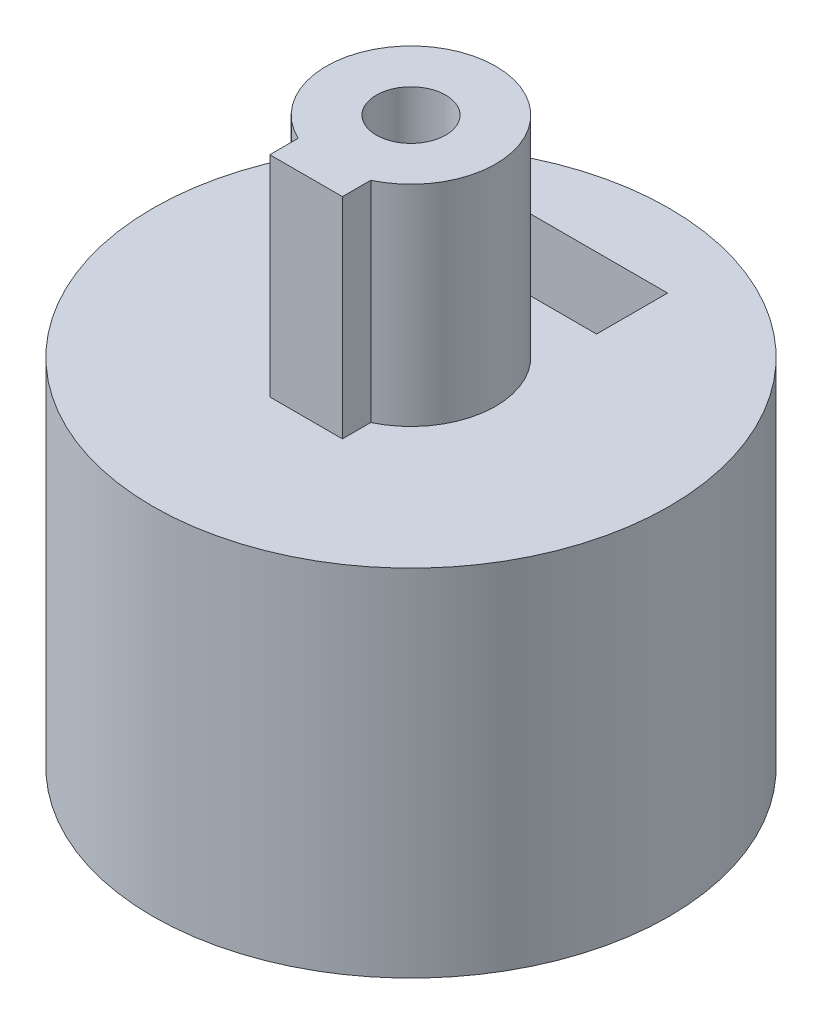
ISO-10303-21;
HEADER;
FILE_DESCRIPTION(('STEP AP214'),'2;1');
FILE_NAME('part.step','',(''),(''),'','','');
FILE_SCHEMA(('AUTOMOTIVE_DESIGN { 1 0 10303 214 1 1 1 1 }'));
ENDSEC;
DATA;
#1=APPLICATION_CONTEXT('core data for automotive mechanical design processes');
#2=APPLICATION_PROTOCOL_DEFINITION('international standard','automotive_design',2000,#1);
#3=PRODUCT_CONTEXT('',#1,'mechanical');
#4=PRODUCT('Part','Part','',(#3));
#5=PRODUCT_RELATED_PRODUCT_CATEGORY('part','',(#4));
#6=PRODUCT_DEFINITION_FORMATION('','',#4);
#7=PRODUCT_DEFINITION_CONTEXT('part definition',#1,'design');
#8=PRODUCT_DEFINITION('design','',#6,#7);
#9=PRODUCT_DEFINITION_SHAPE('','',#8);
#10=(LENGTH_UNIT() NAMED_UNIT(*) SI_UNIT(.MILLI.,.METRE.));
#11=(NAMED_UNIT(*) PLANE_ANGLE_UNIT() SI_UNIT($,.RADIAN.));
#12=(NAMED_UNIT(*) SI_UNIT($,.STERADIAN.) SOLID_ANGLE_UNIT());
#13=UNCERTAINTY_MEASURE_WITH_UNIT(LENGTH_MEASURE(1.E-05),#10,'distance_accuracy_value','');
#14=(GEOMETRIC_REPRESENTATION_CONTEXT(3) GLOBAL_UNCERTAINTY_ASSIGNED_CONTEXT((#13)) GLOBAL_UNIT_ASSIGNED_CONTEXT((#10,
#11,#12)) REPRESENTATION_CONTEXT('',''));
#15=CARTESIAN_POINT('',(0.,0.,0.));
#16=DIRECTION('',(0.,0.,1.));
#17=DIRECTION('',(1.,0.,0.));
#18=AXIS2_PLACEMENT_3D('',#15,#16,#17);
#19=CARTESIAN_POINT('',(0.,7.,-8.));
#20=DIRECTION('',(0.,0.,1.));
#21=DIRECTION('',(1.,0.,0.));
#22=AXIS2_PLACEMENT_3D('',#19,#20,#21);
#23=CYLINDRICAL_SURFACE('',#22,1.075);
#24=CARTESIAN_POINT('',(0.,8.075,-8.));
#25=CARTESIAN_POINT('',(-0.060092794416397,8.0749974716429,-7.99999911181547));
#26=CARTESIAN_POINT('',(-0.120222192972751,8.06994419701879,-7.99931577898279));
#27=CARTESIAN_POINT('',(-0.238805133904426,8.04986697138058,-7.99665557002145));
#28=CARTESIAN_POINT('',(-0.29725690477915,8.03483285792277,-7.99467737549948));
#29=CARTESIAN_POINT('',(-0.410750903373487,7.99524717671987,-7.98965010312977));
#30=CARTESIAN_POINT('',(-0.465795495107335,7.97070229568787,-7.98660177779764));
#31=CARTESIAN_POINT('',(-0.570974704442025,7.91280707597931,-7.97977249916764));
#32=CARTESIAN_POINT('',(-0.621110105394015,7.8794581452991,-7.97599166304299));
#33=CARTESIAN_POINT('',(-0.715374578934897,7.80467629140163,-7.96809215514065));
#34=CARTESIAN_POINT('',(-0.759468116078188,7.7631987590954,-7.96397169531925));
#35=CARTESIAN_POINT('',(-0.840090960456325,7.67343298240961,-7.95587160681168));
#36=CARTESIAN_POINT('',(-0.876619865343444,7.6251443759921,-7.95189198562576));
#37=CARTESIAN_POINT('',(-0.941211112757503,7.52289333607248,-7.9445066814414));
#38=CARTESIAN_POINT('',(-0.96923975909554,7.46890943589338,-7.94110330569616));
#39=CARTESIAN_POINT('',(-1.01581962032494,7.35694724671609,-7.93527976050471));
#40=CARTESIAN_POINT('',(-1.03437124968407,7.29896913252668,-7.9328595480618));
#41=CARTESIAN_POINT('',(-1.06136159068698,7.1810350299197,-7.92929364263999));
#42=CARTESIAN_POINT('',(-1.06986062842502,7.12109308156808,-7.92814034982218));
#43=CARTESIAN_POINT('',(-1.07669127649231,7.00062347246384,-7.92721568300875));
#44=CARTESIAN_POINT('',(-1.07502335732068,6.94009583894456,-7.92744424506463));
#45=CARTESIAN_POINT('',(-1.06161687859971,6.82059545416212,-7.92925050898512));
#46=CARTESIAN_POINT('',(-1.04994502946319,6.76161506442997,-7.93081927358998));
#47=CARTESIAN_POINT('',(-1.01696621809526,6.64645766408446,-7.93511523718938));
#48=CARTESIAN_POINT('',(-0.995659033025943,6.59028071834016,-7.93784246297574));
#49=CARTESIAN_POINT('',(-0.943943504820709,6.48211913483119,-7.94415810307942));
#50=CARTESIAN_POINT('',(-0.91350643259143,6.43014839814982,-7.94774922866829));
#51=CARTESIAN_POINT('',(-0.844415645078879,6.33202690954449,-7.95538599590865));
#52=CARTESIAN_POINT('',(-0.805761495901629,6.28587646515996,-7.95943166155632));
#53=CARTESIAN_POINT('',(-0.72096534034505,6.20031859555403,-7.96756131308648));
#54=CARTESIAN_POINT('',(-0.674765883601231,6.16096809139185,-7.97164534652604));
#55=CARTESIAN_POINT('',(-0.576387641394186,6.09057119789945,-7.97936135707552));
#56=CARTESIAN_POINT('',(-0.524208838232408,6.05952483314996,-7.9829933328473));
#57=CARTESIAN_POINT('',(-0.415307245576307,6.00661645208213,-7.9893987712116));
#58=CARTESIAN_POINT('',(-0.358582559777428,5.98475829259759,-7.99217187315562));
#59=CARTESIAN_POINT('',(-0.242222292292283,5.95089349797181,-7.99654394552587));
#60=CARTESIAN_POINT('',(-0.182586868427062,5.93888632933432,-7.99814297953514));
#61=CARTESIAN_POINT('',(-0.0625898012162963,5.92513880738972,-7.9999784296808));
#62=CARTESIAN_POINT('',(-0.00223728762374069,5.92332009876711,-8.00022524485916));
#63=CARTESIAN_POINT('',(0.117911724838873,5.92979391809772,-7.99935660669511));
#64=CARTESIAN_POINT('',(0.17770823740325,5.93808619634886,-7.9982411869946));
#65=CARTESIAN_POINT('',(0.294814467290954,5.96448148197648,-7.99477986364423));
#66=CARTESIAN_POINT('',(0.352132822198141,5.98254683979153,-7.99243868319097));
#67=CARTESIAN_POINT('',(0.462926687427366,6.02793613444639,-7.98678776857183));
#68=CARTESIAN_POINT('',(0.516402048969415,6.05526042950856,-7.98347799693244));
#69=CARTESIAN_POINT('',(0.618339997276848,6.11857949699144,-7.97623254623426));
#70=CARTESIAN_POINT('',(0.666771056604777,6.15462460803785,-7.9722932801175));
#71=CARTESIAN_POINT('',(0.756924161786225,6.23429130813548,-7.96423996670908));
#72=CARTESIAN_POINT('',(0.798645897904572,6.27791324677686,-7.96012591135936));
#73=CARTESIAN_POINT('',(0.874476563734168,6.37184181892993,-7.95215429437211));
#74=CARTESIAN_POINT('',(0.908533341440052,6.42219073865829,-7.94829860823129));
#75=CARTESIAN_POINT('',(0.967706275855308,6.52794027022739,-7.94131198807677));
#76=CARTESIAN_POINT('',(0.992822634799581,6.58334076776433,-7.93818103766989));
#77=CARTESIAN_POINT('',(1.0333186048018,6.69745709747159,-7.93301147151021));
#78=CARTESIAN_POINT('',(1.04872692328245,6.75616259029887,-7.93096963792837));
#79=CARTESIAN_POINT('',(1.0694615190423,6.87535712142325,-7.92820050841194));
#80=CARTESIAN_POINT('',(1.0747883447589,6.9358460625182,-7.92747314096993));
#81=CARTESIAN_POINT('',(1.07519762316741,7.05637127799591,-7.92741759795498));
#82=CARTESIAN_POINT('',(1.07036202694493,7.11640728526354,-7.92807822936805));
#83=CARTESIAN_POINT('',(1.050758002377,7.23480464678056,-7.93070009140945));
#84=CARTESIAN_POINT('',(1.03598957841016,7.29316600176818,-7.93266132146445));
#85=CARTESIAN_POINT('',(0.996965959588734,7.40654235253583,-7.93765977747413));
#86=CARTESIAN_POINT('',(0.972715350353342,7.46155895101431,-7.94069648325804));
#87=CARTESIAN_POINT('',(0.91542380231593,7.56675546596662,-7.947504501913));
#88=CARTESIAN_POINT('',(0.882382686123591,7.61693528480755,-7.95127582960813));
#89=CARTESIAN_POINT('',(0.808146125167278,7.71145191495493,-7.95916452760708));
#90=CARTESIAN_POINT('',(0.766889712712126,7.7557406401831,-7.96328434404774));
#91=CARTESIAN_POINT('',(0.67752182553316,7.83679674028432,-7.97138462980383));
#92=CARTESIAN_POINT('',(0.62940874594403,7.87356234938242,-7.97536506622362));
#93=CARTESIAN_POINT('',(0.527448401195865,7.93866876757117,-7.98275767966382));
#94=CARTESIAN_POINT('',(0.473576899941764,7.96697189927829,-7.98616728642009));
#95=CARTESIAN_POINT('',(0.36182787795544,8.01408813755674,-7.99200841937768));
#96=CARTESIAN_POINT('',(0.303954714037578,8.03291138594638,-7.99444099026983));
#97=CARTESIAN_POINT('',(0.204829709402752,8.05611056978133,-7.99747850684169));
#98=CARTESIAN_POINT('',(0.164198584988335,8.0631837007631,-7.99841937272592));
#99=CARTESIAN_POINT('',(0.0823840392326397,8.07262926142087,-7.99968042098374));
#100=CARTESIAN_POINT('',(0.0412006228748808,8.07500173348383,-8.00000060895414));
#101=CARTESIAN_POINT('',(0.,8.075,-8.));
#102=B_SPLINE_CURVE_WITH_KNOTS('',3,(#24,#25,#26,#27,#28,#29,#30,#31,#32,#33,#34,#35,#36,#37,
#38,#39,#40,#41,#42,#43,#44,#45,#46,#47,#48,#49,#50,#51,#52,#53,#54,#55,#56,#57,#58,#59,#60,#61,
#62,#63,#64,#65,#66,#67,#68,#69,#70,#71,#72,#73,#74,#75,#76,#77,#78,#79,#80,#81,#82,#83,#84,#85,
#86,#87,#88,#89,#90,#91,#92,#93,#94,#95,#96,#97,#98,#99,#100,#101),.UNSPECIFIED.,.T.,.F.,(4,2,2,
2,2,2,2,2,2,2,2,2,2,2,2,2,2,2,2,2,2,2,2,2,2,2,2,2,2,2,2,2,2,2,2,2,2,2,4),(0.,0.180127870151951,
0.360439427531591,0.540624443034841,0.720780659709491,0.901954738259969,1.08313845062532,
1.26503128422512,1.44691616224436,1.62770391111915,1.80848329369197,1.98806645987638,
2.16765377952108,2.3478122444801,2.52798022487864,2.7095901096786,2.8912005320482,
3.07288711112452,3.25456385002241,3.43484144840973,3.61511459473094,3.79469815607801,
3.97428866619141,4.15494164250128,4.33560295624333,4.51745862813379,4.69931018613403,
4.8806214395816,5.06192282933772,5.24176779339959,5.42161267818159,5.60137069668138,
5.78113234292997,5.9622814074538,6.14347294141388,6.32545957398501,6.50725109687431,
6.6307508848395,6.75424955917242),.UNSPECIFIED.);
#103=CARTESIAN_POINT('',(0.,8.075,-8.));
#104=VERTEX_POINT('',#103);
#105=EDGE_CURVE('E161',#104,#104,#102,.T.);
#106=ORIENTED_EDGE('',*,*,#105,.F.);
#107=EDGE_LOOP('',(#106));
#108=FACE_BOUND('',#107,.T.);
#109=CARTESIAN_POINT('',(0.,7.,-5.7));
#110=DIRECTION('',(0.,0.,1.));
#111=DIRECTION('',(1.,0.,0.));
#112=AXIS2_PLACEMENT_3D('',#109,#110,#111);
#113=CIRCLE('',#112,1.075);
#114=CARTESIAN_POINT('',(1.075,7.,-5.7));
#115=VERTEX_POINT('',#114);
#116=EDGE_CURVE('E197',#115,#115,#113,.F.);
#117=ORIENTED_EDGE('',*,*,#116,.F.);
#118=EDGE_LOOP('',(#117));
#119=FACE_BOUND('',#118,.T.);
#120=ADVANCED_FACE('F50',(#108,#119),#23,.F.);
#121=CARTESIAN_POINT('',(0.,11.,0.));
#122=DIRECTION('',(0.,1.,0.));
#123=DIRECTION('',(0.,0.,1.));
#124=AXIS2_PLACEMENT_3D('',#121,#122,#123);
#125=PLANE('',#124);
#126=DIRECTION('',(0.,0.,1.));
#127=VECTOR('',#126,1.);
#128=CARTESIAN_POINT('',(-1.125,11.,0.));
#129=LINE('',#128,#127);
#130=CARTESIAN_POINT('',(-1.125,11.,2.37170824512628));
#131=VERTEX_POINT('',#130);
#132=CARTESIAN_POINT('',(-1.125,11.,3.25));
#133=VERTEX_POINT('',#132);
#134=EDGE_CURVE('E222',#131,#133,#129,.T.);
#135=ORIENTED_EDGE('',*,*,#134,.F.);
#136=CARTESIAN_POINT('',(0.,11.,0.));
#137=DIRECTION('',(0.,1.,0.));
#138=DIRECTION('',(0.,0.,1.));
#139=AXIS2_PLACEMENT_3D('',#136,#137,#138);
#140=CIRCLE('',#139,2.625);
#141=CARTESIAN_POINT('',(1.125,11.,2.37170824512628));
#142=VERTEX_POINT('',#141);
#143=EDGE_CURVE('E211',#142,#131,#140,.T.);
#144=ORIENTED_EDGE('',*,*,#143,.F.);
#145=DIRECTION('',(0.,0.,1.));
#146=VECTOR('',#145,1.);
#147=CARTESIAN_POINT('',(1.125,11.,0.));
#148=LINE('',#147,#146);
#149=CARTESIAN_POINT('',(1.125,11.,3.25));
#150=VERTEX_POINT('',#149);
#151=EDGE_CURVE('E216',#142,#150,#148,.T.);
#152=ORIENTED_EDGE('',*,*,#151,.T.);
#153=DIRECTION('',(1.,0.,0.));
#154=VECTOR('',#153,1.);
#155=CARTESIAN_POINT('',(0.,11.,3.25));
#156=LINE('',#155,#154);
#157=EDGE_CURVE('E225',#133,#150,#156,.T.);
#158=ORIENTED_EDGE('',*,*,#157,.F.);
#159=EDGE_LOOP('',(#135,#144,#152,#158));
#160=FACE_BOUND('',#159,.T.);
#161=CARTESIAN_POINT('',(0.,11.,0.));
#162=DIRECTION('',(0.,1.,0.));
#163=DIRECTION('',(0.,0.,1.));
#164=AXIS2_PLACEMENT_3D('',#161,#162,#163);
#165=CIRCLE('',#164,8.);
#166=CARTESIAN_POINT('',(0.,11.,8.));
#167=VERTEX_POINT('',#166);
#168=EDGE_CURVE('E155',#167,#167,#165,.T.);
#169=ORIENTED_EDGE('',*,*,#168,.T.);
#170=EDGE_LOOP('',(#169));
#171=FACE_BOUND('',#170,.T.);
#172=DIRECTION('',(0.,0.,-1.));
#173=VECTOR('',#172,1.);
#174=CARTESIAN_POINT('',(-2.25,11.,0.));
#175=LINE('',#174,#173);
#176=CARTESIAN_POINT('',(-2.25,11.,-3.5));
#177=VERTEX_POINT('',#176);
#178=CARTESIAN_POINT('',(-2.25,11.,-5.7));
#179=VERTEX_POINT('',#178);
#180=EDGE_CURVE('E252',#177,#179,#175,.T.);
#181=ORIENTED_EDGE('',*,*,#180,.T.);
#182=DIRECTION('',(1.,0.,0.));
#183=VECTOR('',#182,1.);
#184=CARTESIAN_POINT('',(0.,11.,-5.7));
#185=LINE('',#184,#183);
#186=CARTESIAN_POINT('',(2.25,11.,-5.7));
#187=VERTEX_POINT('',#186);
#188=EDGE_CURVE('E59',#179,#187,#185,.T.);
#189=ORIENTED_EDGE('',*,*,#188,.T.);
#190=DIRECTION('',(0.,0.,-1.));
#191=VECTOR('',#190,1.);
#192=CARTESIAN_POINT('',(2.25,11.,0.));
#193=LINE('',#192,#191);
#194=CARTESIAN_POINT('',(2.25,11.,-3.5));
#195=VERTEX_POINT('',#194);
#196=EDGE_CURVE('E256',#195,#187,#193,.T.);
#197=ORIENTED_EDGE('',*,*,#196,.F.);
#198=DIRECTION('',(1.,0.,0.));
#199=VECTOR('',#198,1.);
#200=CARTESIAN_POINT('',(0.,11.,-3.5));
#201=LINE('',#200,#199);
#202=EDGE_CURVE('E166',#177,#195,#201,.T.);
#203=ORIENTED_EDGE('',*,*,#202,.F.);
#204=EDGE_LOOP('',(#181,#189,#197,#203));
#205=FACE_BOUND('',#204,.T.);
#206=ADVANCED_FACE('F174',(#160,#171,#205),#125,.T.);
#207=CARTESIAN_POINT('',(0.,7.,-3.5));
#208=DIRECTION('',(0.,0.,1.));
#209=DIRECTION('',(1.,0.,0.));
#210=AXIS2_PLACEMENT_3D('',#207,#208,#209);
#211=CIRCLE('',#210,1.075);
#212=CARTESIAN_POINT('',(1.075,7.,-3.5));
#213=VERTEX_POINT('',#212);
#214=EDGE_CURVE('E200',#213,#213,#211,.F.);
#215=ORIENTED_EDGE('',*,*,#214,.T.);
#216=EDGE_LOOP('',(#215));
#217=FACE_BOUND('',#216,.T.);
#218=CARTESIAN_POINT('',(1.075,7.,-2.00499376557634));
#219=CARTESIAN_POINT('',(1.07499658361877,6.94352037809687,-2.0049977706581));
#220=CARTESIAN_POINT('',(1.07051985481672,6.88695900578991,-2.00741574809032));
#221=CARTESIAN_POINT('',(1.05282419906217,6.77553531061269,-2.01675000419458));
#222=CARTESIAN_POINT('',(1.0395849365136,6.72067725147344,-2.02367674593407));
#223=CARTESIAN_POINT('',(1.00503753676983,6.61447764296661,-2.04105190266438));
#224=CARTESIAN_POINT('',(0.983768735298126,6.56312036888871,-2.05148312265038));
#225=CARTESIAN_POINT('',(0.93388521183156,6.46471537598709,-2.07466560794858));
#226=CARTESIAN_POINT('',(0.905270800115793,6.41766747524901,-2.0874167752594));
#227=CARTESIAN_POINT('',(0.839046224804819,6.32540208389258,-2.11494734394164));
#228=CARTESIAN_POINT('',(0.800930673150271,6.28057107594533,-2.12980689566071));
#229=CARTESIAN_POINT('',(0.71784039306809,6.19764232605115,-2.15922964515003));
#230=CARTESIAN_POINT('',(0.672862556988997,6.15954765167811,-2.17379270524734));
#231=CARTESIAN_POINT('',(0.574096126088812,6.0889941954935,-2.20200460628538));
#232=CARTESIAN_POINT('',(0.51994555627536,6.05699682556436,-2.21554977860469));
#233=CARTESIAN_POINT('',(0.406271271855638,6.00273968867275,-2.23918056084756));
#234=CARTESIAN_POINT('',(0.346750617098963,5.98047441815296,-2.24926812536946));
#235=CARTESIAN_POINT('',(0.228108268458676,5.94779823494566,-2.26427296932229));
#236=CARTESIAN_POINT('',(0.169209918374028,5.93671355249755,-2.26948253755475));
#237=CARTESIAN_POINT('',(0.0501756923304657,5.92450876883154,-2.27522536958065));
#238=CARTESIAN_POINT('',(-0.00995950747421294,5.92338336101428,-2.27576112371986));
#239=CARTESIAN_POINT('',(-0.124753974480553,5.93083628273936,-2.27224643987149));
#240=CARTESIAN_POINT('',(-0.179475005720044,5.93866579956152,-2.26854988323864));
#241=CARTESIAN_POINT('',(-0.286718588761961,5.96248605619345,-2.25750397557095));
#242=CARTESIAN_POINT('',(-0.33924097683198,5.9784774026469,-2.25015435301602));
#243=CARTESIAN_POINT('',(-0.441554827354227,6.01831052326573,-2.23235148360207));
#244=CARTESIAN_POINT('',(-0.49129446474757,6.04226481374099,-2.22185397840715));
#245=CARTESIAN_POINT('',(-0.586175402723223,6.09720873205379,-2.19872954500003));
#246=CARTESIAN_POINT('',(-0.631315010607889,6.12820093622425,-2.18610183743199));
#247=CARTESIAN_POINT('',(-0.719886613078505,6.19944250065705,-2.15863854746812));
#248=CARTESIAN_POINT('',(-0.7628308990752,6.24026163344897,-2.14370646276313));
#249=CARTESIAN_POINT('',(-0.841511074695959,6.32844984411755,-2.11406136073225));
#250=CARTESIAN_POINT('',(-0.877242436828807,6.37582300465857,-2.09934848633533));
#251=CARTESIAN_POINT('',(-0.942280406152763,6.47881857548984,-2.07100402455298));
#252=CARTESIAN_POINT('',(-0.971156378892116,6.53474182667014,-2.05746842957346));
#253=CARTESIAN_POINT('',(-1.0188746622517,6.6514544678604,-2.03426426506451));
#254=CARTESIAN_POINT('',(-1.03772642303789,6.71223921234676,-2.0245920555386));
#255=CARTESIAN_POINT('',(-1.06343409132714,6.83207686747855,-2.0112009733404));
#256=CARTESIAN_POINT('',(-1.07108995187181,6.8909126359256,-2.00708691025632));
#257=CARTESIAN_POINT('',(-1.07658655624566,7.00915928186688,-2.00414552042917));
#258=CARTESIAN_POINT('',(-1.07443271470559,7.06856982403745,-2.00531527718954));
#259=CARTESIAN_POINT('',(-1.06110471902395,7.18044537910263,-2.01239324621807));
#260=CARTESIAN_POINT('',(-1.05078321756229,7.23304458857963,-2.01785322418241));
#261=CARTESIAN_POINT('',(-1.02263077816888,7.33568593033835,-2.03226460173223));
#262=CARTESIAN_POINT('',(-1.00479769707382,7.38572732826628,-2.04121699770167));
#263=CARTESIAN_POINT('',(-0.961241943776019,7.48444173717355,-2.06209739944632));
#264=CARTESIAN_POINT('',(-0.935192961201697,7.53294483838103,-2.07414372698382));
#265=CARTESIAN_POINT('',(-0.876241224937739,7.62515973038128,-2.09972811922533));
#266=CARTESIAN_POINT('',(-0.843335051968267,7.66886911416816,-2.11326692654936));
#267=CARTESIAN_POINT('',(-0.767358308352441,7.75528067691271,-2.14210429596524));
#268=CARTESIAN_POINT('',(-0.723567675570702,7.79734265974701,-2.15743255182857));
#269=CARTESIAN_POINT('',(-0.629259383115979,7.8736926329007,-2.18680028603334));
#270=CARTESIAN_POINT('',(-0.578740179529363,7.90797883412249,-2.20083946733561));
#271=CARTESIAN_POINT('',(-0.471184745044899,7.96822972786095,-2.22636713797464));
#272=CARTESIAN_POINT('',(-0.414054729624578,7.99404776659325,-2.23780971411247));
#273=CARTESIAN_POINT('',(-0.29556891973965,8.03546801010164,-2.25651273696619));
#274=CARTESIAN_POINT('',(-0.234216474110518,8.05107820989504,-2.26377645612285));
#275=CARTESIAN_POINT('',(-0.114659241019512,8.07043404997335,-2.27283168138583));
#276=CARTESIAN_POINT('',(-0.0566301928492878,8.07507541792166,-2.27503585617896));
#277=CARTESIAN_POINT('',(0.0594048791562423,8.07492279198013,-2.27496329801195));
#278=CARTESIAN_POINT('',(0.117410904895417,8.07013143309525,-2.27268781643086));
#279=CARTESIAN_POINT('',(0.228437139740304,8.05187203258533,-2.26415009403731));
#280=CARTESIAN_POINT('',(0.281556605611876,8.0388923185585,-2.25811245053978));
#281=CARTESIAN_POINT('',(0.384800886986935,8.00523773908891,-2.24282830588852));
#282=CARTESIAN_POINT('',(0.434925224571048,7.9845616493546,-2.2335812942243));
#283=CARTESIAN_POINT('',(0.533273794020516,7.93509890517152,-2.21221399085242));
#284=CARTESIAN_POINT('',(0.581310579968736,7.90598871641568,-2.19998298698338));
#285=CARTESIAN_POINT('',(0.672026729836986,7.84090727092433,-2.17399067453018));
#286=CARTESIAN_POINT('',(0.71470364611605,7.80493289834196,-2.16022867217004));
#287=CARTESIAN_POINT('',(0.797499262336585,7.7233887666038,-2.13112967505797));
#288=CARTESIAN_POINT('',(0.837046873765155,7.67724829887593,-2.11576197956525));
#289=CARTESIAN_POINT('',(0.908005555387062,7.57865457131097,-2.08629609065312));
#290=CARTESIAN_POINT('',(0.939410643983241,7.52619671183536,-2.07219883544656));
#291=CARTESIAN_POINT('',(0.993530505876132,7.41520623881881,-2.04681061621627));
#292=CARTESIAN_POINT('',(1.01609518975948,7.35658850242082,-2.0355691715913));
#293=CARTESIAN_POINT('',(1.05070153355639,7.23573865117137,-2.01792946864943));
#294=CARTESIAN_POINT('',(1.06277852037696,7.17351942911748,-2.01151496103282));
#295=CARTESIAN_POINT('',(1.07119037590385,7.09230433500277,-2.00703202473711));
#296=CARTESIAN_POINT('',(1.0726172324136,7.07388377145361,-2.00626975664607));
#297=CARTESIAN_POINT('',(1.07452262792992,7.03697839572768,-2.00524995850825));
#298=CARTESIAN_POINT('',(1.07500111865339,7.01849358032772,-2.00499245415996));
#299=CARTESIAN_POINT('',(1.075,7.,-2.00499376557634));
#300=B_SPLINE_CURVE_WITH_KNOTS('',3,(#218,#219,#220,#221,#222,#223,#224,#225,#226,#227,#228,
#229,#230,#231,#232,#233,#234,#235,#236,#237,#238,#239,#240,#241,#242,#243,#244,#245,#246,#247,
#248,#249,#250,#251,#252,#253,#254,#255,#256,#257,#258,#259,#260,#261,#262,#263,#264,#265,#266,
#267,#268,#269,#270,#271,#272,#273,#274,#275,#276,#277,#278,#279,#280,#281,#282,#283,#284,#285,
#286,#287,#288,#289,#290,#291,#292,#293,#294,#295,#296,#297,#298,#299),.UNSPECIFIED.,.T.,.F.,(4,
2,2,2,2,2,2,2,2,2,2,2,2,2,2,2,2,2,2,2,2,2,2,2,2,2,2,2,2,2,2,2,2,2,2,2,2,2,2,2,4),(0.,
0.169361138035443,0.339116704556781,0.508051229186817,0.676978619184486,0.858279295173719,
1.03966231996277,1.23168036899097,1.42358968979281,1.60308253667038,1.78247973862864,
1.94790715114597,2.11334686116485,2.28123132772306,2.44917735023813,2.63169043998003,
2.81431773783549,3.00644038715383,3.19838159334542,3.37579501751972,3.5531105272295,
3.71402727109224,3.87498995798282,4.04338589524176,4.21186600350035,4.39888716973171,
4.58595132333593,4.77610232186768,4.966104210758,5.13995544816866,5.31375812762987,
5.47806557166228,5.64239916387788,5.81413902375453,5.98595702746548,6.17315738195808,
6.36049486896152,6.55088775539554,6.7406368040817,6.79608927094458,6.85154456092552),.UNSPECIFIED.);
#301=CARTESIAN_POINT('',(1.075,7.,-2.00499376557634));
#302=VERTEX_POINT('',#301);
#303=EDGE_CURVE('E149',#302,#302,#300,.T.);
#304=ORIENTED_EDGE('',*,*,#303,.F.);
#305=EDGE_LOOP('',(#304));
#306=FACE_BOUND('',#305,.T.);
#307=ADVANCED_FACE('F171',(#217,#306),#23,.F.);
#308=CARTESIAN_POINT('',(0.,10.,0.));
#309=DIRECTION('',(0.,-1.,0.));
#310=DIRECTION('',(0.,0.,-1.));
#311=AXIS2_PLACEMENT_3D('',#308,#309,#310);
#312=CYLINDRICAL_SURFACE('',#311,8.);
#313=ORIENTED_EDGE('',*,*,#105,.T.);
#314=EDGE_LOOP('',(#313));
#315=FACE_BOUND('',#314,.T.);
#316=CARTESIAN_POINT('',(0.,0.,0.));
#317=DIRECTION('',(0.,1.,0.));
#318=DIRECTION('',(0.,0.,1.));
#319=AXIS2_PLACEMENT_3D('',#316,#317,#318);
#320=CIRCLE('',#319,8.);
#321=CARTESIAN_POINT('',(0.,0.,8.));
#322=VERTEX_POINT('',#321);
#323=EDGE_CURVE('E153',#322,#322,#320,.T.);
#324=ORIENTED_EDGE('',*,*,#323,.T.);
#325=EDGE_LOOP('',(#324));
#326=FACE_BOUND('',#325,.T.);
#327=ORIENTED_EDGE('',*,*,#168,.F.);
#328=EDGE_LOOP('',(#327));
#329=FACE_BOUND('',#328,.T.);
#330=ADVANCED_FACE('F52',(#315,#326,#329),#312,.T.);
#331=CARTESIAN_POINT('',(0.,0.,0.));
#332=DIRECTION('',(0.,1.,0.));
#333=DIRECTION('',(0.,0.,1.));
#334=AXIS2_PLACEMENT_3D('',#331,#332,#333);
#335=PLANE('',#334);
#336=CARTESIAN_POINT('',(0.,0.,0.));
#337=DIRECTION('',(0.,1.,0.));
#338=DIRECTION('',(0.,0.,1.));
#339=AXIS2_PLACEMENT_3D('',#336,#337,#338);
#340=CIRCLE('',#339,2.275);
#341=CARTESIAN_POINT('',(1.93277650027105,0.,1.2));
#342=VERTEX_POINT('',#341);
#343=CARTESIAN_POINT('',(-1.93277650027105,0.,1.2));
#344=VERTEX_POINT('',#343);
#345=EDGE_CURVE('E138',#342,#344,#340,.T.);
#346=ORIENTED_EDGE('',*,*,#345,.T.);
#347=DIRECTION('',(1.,0.,0.));
#348=VECTOR('',#347,1.);
#349=CARTESIAN_POINT('',(-2.05966399967005,0.,1.2));
#350=LINE('',#349,#348);
#351=EDGE_CURVE('E133',#344,#342,#350,.T.);
#352=ORIENTED_EDGE('',*,*,#351,.T.);
#353=EDGE_LOOP('',(#346,#352));
#354=FACE_BOUND('',#353,.T.);
#355=ORIENTED_EDGE('',*,*,#323,.F.);
#356=EDGE_LOOP('',(#355));
#357=FACE_BOUND('',#356,.T.);
#358=ADVANCED_FACE('F135',(#354,#357),#335,.F.);
#359=CARTESIAN_POINT('',(0.,10.,0.));
#360=DIRECTION('',(0.,-1.,0.));
#361=DIRECTION('',(0.,0.,-1.));
#362=AXIS2_PLACEMENT_3D('',#359,#360,#361);
#363=CYLINDRICAL_SURFACE('',#362,2.275);
#364=DIRECTION('',(0.,-1.,0.));
#365=VECTOR('',#364,1.);
#366=CARTESIAN_POINT('',(-1.93277650027105,10.,1.2));
#367=LINE('',#366,#365);
#368=CARTESIAN_POINT('',(-1.93277650027105,10.,1.2));
#369=VERTEX_POINT('',#368);
#370=EDGE_CURVE('E66',#344,#369,#367,.F.);
#371=ORIENTED_EDGE('',*,*,#370,.F.);
#372=ORIENTED_EDGE('',*,*,#345,.F.);
#373=DIRECTION('',(0.,-1.,0.));
#374=VECTOR('',#373,1.);
#375=CARTESIAN_POINT('',(1.93277650027105,14.5337043240979,1.2));
#376=LINE('',#375,#374);
#377=CARTESIAN_POINT('',(1.93277650027105,10.,1.2));
#378=VERTEX_POINT('',#377);
#379=EDGE_CURVE('E139',#378,#342,#376,.T.);
#380=ORIENTED_EDGE('',*,*,#379,.F.);
#381=CARTESIAN_POINT('',(0.,10.,0.));
#382=DIRECTION('',(0.,1.,0.));
#383=DIRECTION('',(0.,0.,1.));
#384=AXIS2_PLACEMENT_3D('',#381,#382,#383);
#385=CIRCLE('',#384,2.275);
#386=EDGE_CURVE('E150',#378,#369,#385,.T.);
#387=ORIENTED_EDGE('',*,*,#386,.T.);
#388=EDGE_LOOP('',(#371,#372,#380,#387));
#389=FACE_BOUND('',#388,.T.);
#390=ORIENTED_EDGE('',*,*,#303,.T.);
#391=EDGE_LOOP('',(#390));
#392=FACE_BOUND('',#391,.T.);
#393=ADVANCED_FACE('F147',(#389,#392),#363,.F.);
#394=CARTESIAN_POINT('',(0.,10.,0.));
#395=DIRECTION('',(0.,1.,0.));
#396=DIRECTION('',(0.,0.,1.));
#397=AXIS2_PLACEMENT_3D('',#394,#395,#396);
#398=PLANE('',#397);
#399=ORIENTED_EDGE('',*,*,#386,.F.);
#400=DIRECTION('',(-1.,0.,0.));
#401=VECTOR('',#400,1.);
#402=CARTESIAN_POINT('',(0.,10.,1.2));
#403=LINE('',#402,#401);
#404=EDGE_CURVE('E12',#378,#369,#403,.T.);
#405=ORIENTED_EDGE('',*,*,#404,.T.);
#406=EDGE_LOOP('',(#399,#405));
#407=FACE_BOUND('',#406,.T.);
#408=ADVANCED_FACE('F184',(#407),#398,.F.);
#409=CARTESIAN_POINT('',(-1.125,17.5,0.));
#410=DIRECTION('',(1.,0.,0.));
#411=DIRECTION('',(0.,0.,-1.));
#412=AXIS2_PLACEMENT_3D('',#409,#410,#411);
#413=PLANE('',#412);
#414=ORIENTED_EDGE('',*,*,#134,.T.);
#415=DIRECTION('',(0.,-1.,0.));
#416=VECTOR('',#415,1.);
#417=CARTESIAN_POINT('',(-1.125,17.5,3.25));
#418=LINE('',#417,#416);
#419=CARTESIAN_POINT('',(-1.125,17.5,3.25));
#420=VERTEX_POINT('',#419);
#421=EDGE_CURVE('E235',#420,#133,#418,.T.);
#422=ORIENTED_EDGE('',*,*,#421,.F.);
#423=DIRECTION('',(0.,0.,1.));
#424=VECTOR('',#423,1.);
#425=CARTESIAN_POINT('',(-1.125,17.5,0.));
#426=LINE('',#425,#424);
#427=CARTESIAN_POINT('',(-1.125,17.5,2.37170824512628));
#428=VERTEX_POINT('',#427);
#429=EDGE_CURVE('E213',#428,#420,#426,.T.);
#430=ORIENTED_EDGE('',*,*,#429,.F.);
#431=DIRECTION('',(0.,-1.,0.));
#432=VECTOR('',#431,1.);
#433=CARTESIAN_POINT('',(-1.125,17.5,2.37170824512628));
#434=LINE('',#433,#432);
#435=EDGE_CURVE('E238',#428,#131,#434,.T.);
#436=ORIENTED_EDGE('',*,*,#435,.T.);
#437=EDGE_LOOP('',(#414,#422,#430,#436));
#438=FACE_BOUND('',#437,.T.);
#439=ADVANCED_FACE('F332',(#438),#413,.F.);
#440=CARTESIAN_POINT('',(0.,17.5,3.25));
#441=DIRECTION('',(0.,0.,-1.));
#442=DIRECTION('',(-1.,0.,0.));
#443=AXIS2_PLACEMENT_3D('',#440,#441,#442);
#444=PLANE('',#443);
#445=ORIENTED_EDGE('',*,*,#157,.T.);
#446=DIRECTION('',(0.,-1.,0.));
#447=VECTOR('',#446,1.);
#448=CARTESIAN_POINT('',(1.125,17.5,3.25));
#449=LINE('',#448,#447);
#450=CARTESIAN_POINT('',(1.125,17.5,3.25));
#451=VERTEX_POINT('',#450);
#452=EDGE_CURVE('E232',#451,#150,#449,.T.);
#453=ORIENTED_EDGE('',*,*,#452,.F.);
#454=DIRECTION('',(1.,0.,0.));
#455=VECTOR('',#454,1.);
#456=CARTESIAN_POINT('',(0.,17.5,3.25));
#457=LINE('',#456,#455);
#458=EDGE_CURVE('E215',#420,#451,#457,.T.);
#459=ORIENTED_EDGE('',*,*,#458,.F.);
#460=ORIENTED_EDGE('',*,*,#421,.T.);
#461=EDGE_LOOP('',(#445,#453,#459,#460));
#462=FACE_BOUND('',#461,.T.);
#463=ADVANCED_FACE('F328',(#462),#444,.F.);
#464=CARTESIAN_POINT('',(1.125,17.5,0.));
#465=DIRECTION('',(1.,0.,0.));
#466=DIRECTION('',(0.,0.,-1.));
#467=AXIS2_PLACEMENT_3D('',#464,#465,#466);
#468=PLANE('',#467);
#469=ORIENTED_EDGE('',*,*,#151,.F.);
#470=DIRECTION('',(0.,-1.,0.));
#471=VECTOR('',#470,1.);
#472=CARTESIAN_POINT('',(1.125,17.5,2.37170824512628));
#473=LINE('',#472,#471);
#474=CARTESIAN_POINT('',(1.125,17.5,2.37170824512628));
#475=VERTEX_POINT('',#474);
#476=EDGE_CURVE('E221',#475,#142,#473,.T.);
#477=ORIENTED_EDGE('',*,*,#476,.F.);
#478=DIRECTION('',(0.,0.,1.));
#479=VECTOR('',#478,1.);
#480=CARTESIAN_POINT('',(1.125,17.5,0.));
#481=LINE('',#480,#479);
#482=EDGE_CURVE('E218',#475,#451,#481,.T.);
#483=ORIENTED_EDGE('',*,*,#482,.T.);
#484=ORIENTED_EDGE('',*,*,#452,.T.);
#485=EDGE_LOOP('',(#469,#477,#483,#484));
#486=FACE_BOUND('',#485,.T.);
#487=ADVANCED_FACE('F324',(#486),#468,.T.);
#488=CARTESIAN_POINT('',(0.,17.5,0.));
#489=DIRECTION('',(0.,1.,0.));
#490=DIRECTION('',(0.,0.,1.));
#491=AXIS2_PLACEMENT_3D('',#488,#489,#490);
#492=PLANE('',#491);
#493=CARTESIAN_POINT('',(0.,17.5,0.));
#494=DIRECTION('',(0.,1.,0.));
#495=DIRECTION('',(0.,0.,1.));
#496=AXIS2_PLACEMENT_3D('',#493,#494,#495);
#497=CIRCLE('',#496,1.075);
#498=CARTESIAN_POINT('',(0.,17.5,1.075));
#499=VERTEX_POINT('',#498);
#500=EDGE_CURVE('E199',#499,#499,#497,.T.);
#501=ORIENTED_EDGE('',*,*,#500,.F.);
#502=EDGE_LOOP('',(#501));
#503=FACE_BOUND('',#502,.T.);
#504=ORIENTED_EDGE('',*,*,#482,.F.);
#505=CARTESIAN_POINT('',(0.,17.5,0.));
#506=DIRECTION('',(0.,1.,0.));
#507=DIRECTION('',(0.,0.,1.));
#508=AXIS2_PLACEMENT_3D('',#505,#506,#507);
#509=CIRCLE('',#508,2.625);
#510=EDGE_CURVE('E226',#475,#428,#509,.T.);
#511=ORIENTED_EDGE('',*,*,#510,.T.);
#512=ORIENTED_EDGE('',*,*,#429,.T.);
#513=ORIENTED_EDGE('',*,*,#458,.T.);
#514=EDGE_LOOP('',(#504,#511,#512,#513));
#515=FACE_BOUND('',#514,.T.);
#516=ADVANCED_FACE('F321',(#503,#515),#492,.T.);
#517=CARTESIAN_POINT('',(0.,17.5,0.));
#518=DIRECTION('',(0.,-1.,0.));
#519=DIRECTION('',(0.,0.,-1.));
#520=AXIS2_PLACEMENT_3D('',#517,#518,#519);
#521=CYLINDRICAL_SURFACE('',#520,2.625);
#522=ORIENTED_EDGE('',*,*,#143,.T.);
#523=ORIENTED_EDGE('',*,*,#435,.F.);
#524=ORIENTED_EDGE('',*,*,#510,.F.);
#525=ORIENTED_EDGE('',*,*,#476,.T.);
#526=EDGE_LOOP('',(#522,#523,#524,#525));
#527=FACE_BOUND('',#526,.T.);
#528=ADVANCED_FACE('F319',(#527),#521,.T.);
#529=CARTESIAN_POINT('',(0.,11.5,0.));
#530=DIRECTION('',(0.,1.,0.));
#531=DIRECTION('',(0.,0.,1.));
#532=AXIS2_PLACEMENT_3D('',#529,#530,#531);
#533=CYLINDRICAL_SURFACE('',#532,1.075);
#534=CARTESIAN_POINT('',(0.,11.5,0.));
#535=DIRECTION('',(0.,1.,0.));
#536=DIRECTION('',(0.,0.,1.));
#537=AXIS2_PLACEMENT_3D('',#534,#535,#536);
#538=CIRCLE('',#537,1.075);
#539=CARTESIAN_POINT('',(0.,11.5,1.075));
#540=VERTEX_POINT('',#539);
#541=EDGE_CURVE('E203',#540,#540,#538,.T.);
#542=ORIENTED_EDGE('',*,*,#541,.F.);
#543=EDGE_LOOP('',(#542));
#544=FACE_BOUND('',#543,.T.);
#545=ORIENTED_EDGE('',*,*,#500,.T.);
#546=EDGE_LOOP('',(#545));
#547=FACE_BOUND('',#546,.T.);
#548=ADVANCED_FACE('F315',(#544,#547),#533,.F.);
#549=CARTESIAN_POINT('',(0.,11.5,0.));
#550=DIRECTION('',(0.,1.,0.));
#551=DIRECTION('',(0.,0.,1.));
#552=AXIS2_PLACEMENT_3D('',#549,#550,#551);
#553=PLANE('',#552);
#554=ORIENTED_EDGE('',*,*,#541,.T.);
#555=EDGE_LOOP('',(#554));
#556=FACE_BOUND('',#555,.T.);
#557=ADVANCED_FACE('F312',(#556),#553,.T.);
#558=CARTESIAN_POINT('',(0.,0.,-5.7));
#559=DIRECTION('',(0.,0.,1.));
#560=DIRECTION('',(1.,0.,0.));
#561=AXIS2_PLACEMENT_3D('',#558,#559,#560);
#562=PLANE('',#561);
#563=DIRECTION('',(0.,1.,0.));
#564=VECTOR('',#563,1.);
#565=CARTESIAN_POINT('',(-2.25,0.,-5.7));
#566=LINE('',#565,#564);
#567=CARTESIAN_POINT('',(-2.25,5.70096189432334,-5.7));
#568=VERTEX_POINT('',#567);
#569=EDGE_CURVE('E270',#568,#179,#566,.T.);
#570=ORIENTED_EDGE('',*,*,#569,.F.);
#571=DIRECTION('',(0.866025403784439,-0.5,0.));
#572=VECTOR('',#571,1.);
#573=CARTESIAN_POINT('',(1.90608891324554,3.30144284148502,-5.7));
#574=LINE('',#573,#572);
#575=CARTESIAN_POINT('',(0.,4.40192378864669,-5.7));
#576=VERTEX_POINT('',#575);
#577=EDGE_CURVE('E273',#568,#576,#574,.T.);
#578=ORIENTED_EDGE('',*,*,#577,.T.);
#579=DIRECTION('',(0.866025403784438,0.5,0.));
#580=VECTOR('',#579,1.);
#581=CARTESIAN_POINT('',(-1.90608891324554,3.30144284148501,-5.7));
#582=LINE('',#581,#580);
#583=CARTESIAN_POINT('',(2.25,5.70096189432335,-5.7));
#584=VERTEX_POINT('',#583);
#585=EDGE_CURVE('E286',#576,#584,#582,.T.);
#586=ORIENTED_EDGE('',*,*,#585,.T.);
#587=DIRECTION('',(0.,1.,0.));
#588=VECTOR('',#587,1.);
#589=CARTESIAN_POINT('',(2.25,0.,-5.7));
#590=LINE('',#589,#588);
#591=EDGE_CURVE('E282',#584,#187,#590,.T.);
#592=ORIENTED_EDGE('',*,*,#591,.T.);
#593=ORIENTED_EDGE('',*,*,#188,.F.);
#594=EDGE_LOOP('',(#570,#578,#586,#592,#593));
#595=FACE_BOUND('',#594,.T.);
#596=ORIENTED_EDGE('',*,*,#116,.T.);
#597=EDGE_LOOP('',(#596));
#598=FACE_BOUND('',#597,.T.);
#599=ADVANCED_FACE('F299',(#595,#598),#562,.T.);
#600=CARTESIAN_POINT('',(0.,0.,-3.5));
#601=DIRECTION('',(0.,0.,1.));
#602=DIRECTION('',(1.,0.,0.));
#603=AXIS2_PLACEMENT_3D('',#600,#601,#602);
#604=PLANE('',#603);
#605=ORIENTED_EDGE('',*,*,#202,.T.);
#606=DIRECTION('',(0.,1.,0.));
#607=VECTOR('',#606,1.);
#608=CARTESIAN_POINT('',(2.25,0.,-3.5));
#609=LINE('',#608,#607);
#610=CARTESIAN_POINT('',(2.25,5.70096189432335,-3.5));
#611=VERTEX_POINT('',#610);
#612=EDGE_CURVE('E264',#611,#195,#609,.T.);
#613=ORIENTED_EDGE('',*,*,#612,.F.);
#614=DIRECTION('',(0.866025403784438,0.5,0.));
#615=VECTOR('',#614,1.);
#616=CARTESIAN_POINT('',(-1.90608891324554,3.30144284148501,-3.5));
#617=LINE('',#616,#615);
#618=CARTESIAN_POINT('',(0.,4.40192378864669,-3.5));
#619=VERTEX_POINT('',#618);
#620=EDGE_CURVE('E271',#619,#611,#617,.T.);
#621=ORIENTED_EDGE('',*,*,#620,.F.);
#622=DIRECTION('',(0.866025403784439,-0.5,0.));
#623=VECTOR('',#622,1.);
#624=CARTESIAN_POINT('',(1.90608891324554,3.30144284148502,-3.5));
#625=LINE('',#624,#623);
#626=CARTESIAN_POINT('',(-2.25,5.70096189432334,-3.5));
#627=VERTEX_POINT('',#626);
#628=EDGE_CURVE('E275',#627,#619,#625,.T.);
#629=ORIENTED_EDGE('',*,*,#628,.F.);
#630=DIRECTION('',(0.,1.,0.));
#631=VECTOR('',#630,1.);
#632=CARTESIAN_POINT('',(-2.25,0.,-3.5));
#633=LINE('',#632,#631);
#634=EDGE_CURVE('E73',#627,#177,#633,.T.);
#635=ORIENTED_EDGE('',*,*,#634,.T.);
#636=EDGE_LOOP('',(#605,#613,#621,#629,#635));
#637=FACE_BOUND('',#636,.T.);
#638=ORIENTED_EDGE('',*,*,#214,.F.);
#639=EDGE_LOOP('',(#638));
#640=FACE_BOUND('',#639,.T.);
#641=ADVANCED_FACE('F261',(#637,#640),#604,.F.);
#642=CARTESIAN_POINT('',(2.25,0.,-5.7));
#643=DIRECTION('',(1.,0.,0.));
#644=DIRECTION('',(0.,1.,0.));
#645=AXIS2_PLACEMENT_3D('',#642,#643,#644);
#646=PLANE('',#645);
#647=ORIENTED_EDGE('',*,*,#196,.T.);
#648=ORIENTED_EDGE('',*,*,#591,.F.);
#649=DIRECTION('',(0.,0.,1.));
#650=VECTOR('',#649,1.);
#651=CARTESIAN_POINT('',(2.25,5.70096189432335,-5.7));
#652=LINE('',#651,#650);
#653=EDGE_CURVE('E206',#584,#611,#652,.T.);
#654=ORIENTED_EDGE('',*,*,#653,.T.);
#655=ORIENTED_EDGE('',*,*,#612,.T.);
#656=EDGE_LOOP('',(#647,#648,#654,#655));
#657=FACE_BOUND('',#656,.T.);
#658=ADVANCED_FACE('F266',(#657),#646,.F.);
#659=CARTESIAN_POINT('',(-1.90608891324554,3.30144284148501,-5.7));
#660=DIRECTION('',(0.5,-0.866025403784438,0.));
#661=DIRECTION('',(0.866025403784438,0.5,0.));
#662=AXIS2_PLACEMENT_3D('',#659,#660,#661);
#663=PLANE('',#662);
#664=ORIENTED_EDGE('',*,*,#620,.T.);
#665=ORIENTED_EDGE('',*,*,#653,.F.);
#666=ORIENTED_EDGE('',*,*,#585,.F.);
#667=DIRECTION('',(0.,0.,1.));
#668=VECTOR('',#667,1.);
#669=CARTESIAN_POINT('',(0.,4.40192378864669,-5.7));
#670=LINE('',#669,#668);
#671=EDGE_CURVE('E280',#576,#619,#670,.T.);
#672=ORIENTED_EDGE('',*,*,#671,.T.);
#673=EDGE_LOOP('',(#664,#665,#666,#672));
#674=FACE_BOUND('',#673,.T.);
#675=ADVANCED_FACE('F296',(#674),#663,.F.);
#676=CARTESIAN_POINT('',(1.90608891324554,3.30144284148502,-5.7));
#677=DIRECTION('',(-0.5,-0.866025403784439,0.));
#678=DIRECTION('',(0.866025403784439,-0.5,0.));
#679=AXIS2_PLACEMENT_3D('',#676,#677,#678);
#680=PLANE('',#679);
#681=ORIENTED_EDGE('',*,*,#628,.T.);
#682=ORIENTED_EDGE('',*,*,#671,.F.);
#683=ORIENTED_EDGE('',*,*,#577,.F.);
#684=DIRECTION('',(0.,0.,1.));
#685=VECTOR('',#684,1.);
#686=CARTESIAN_POINT('',(-2.25,5.70096189432334,-5.7));
#687=LINE('',#686,#685);
#688=EDGE_CURVE('E281',#568,#627,#687,.T.);
#689=ORIENTED_EDGE('',*,*,#688,.T.);
#690=EDGE_LOOP('',(#681,#682,#683,#689));
#691=FACE_BOUND('',#690,.T.);
#692=ADVANCED_FACE('F293',(#691),#680,.F.);
#693=CARTESIAN_POINT('',(-2.25,0.,-5.7));
#694=DIRECTION('',(1.,0.,0.));
#695=DIRECTION('',(0.,1.,0.));
#696=AXIS2_PLACEMENT_3D('',#693,#694,#695);
#697=PLANE('',#696);
#698=ORIENTED_EDGE('',*,*,#634,.F.);
#699=ORIENTED_EDGE('',*,*,#688,.F.);
#700=ORIENTED_EDGE('',*,*,#569,.T.);
#701=ORIENTED_EDGE('',*,*,#180,.F.);
#702=EDGE_LOOP('',(#698,#699,#700,#701));
#703=FACE_BOUND('',#702,.T.);
#704=ADVANCED_FACE('F301',(#703),#697,.T.);
#705=CARTESIAN_POINT('',(-2.05966399967005,14.5337043240979,1.2));
#706=DIRECTION('',(0.,0.,-1.));
#707=DIRECTION('',(-1.,0.,0.));
#708=AXIS2_PLACEMENT_3D('',#705,#706,#707);
#709=PLANE('',#708);
#710=ORIENTED_EDGE('',*,*,#351,.F.);
#711=ORIENTED_EDGE('',*,*,#370,.T.);
#712=ORIENTED_EDGE('',*,*,#404,.F.);
#713=ORIENTED_EDGE('',*,*,#379,.T.);
#714=EDGE_LOOP('',(#710,#711,#712,#713));
#715=FACE_BOUND('',#714,.T.);
#716=ADVANCED_FACE('F142',(#715),#709,.T.);
#717=CLOSED_SHELL('',(#120,#206,#307,#330,#358,#393,#408,#439,#463,#487,#516,#528,#548,#557,
#599,#641,#658,#675,#692,#704,#716));
#718=MANIFOLD_SOLID_BREP('B2',#717);
#719=ADVANCED_BREP_SHAPE_REPRESENTATION('',(#18,#718),#14);
#720=SHAPE_DEFINITION_REPRESENTATION(#9,#719);
ENDSEC;
END-ISO-10303-21;
